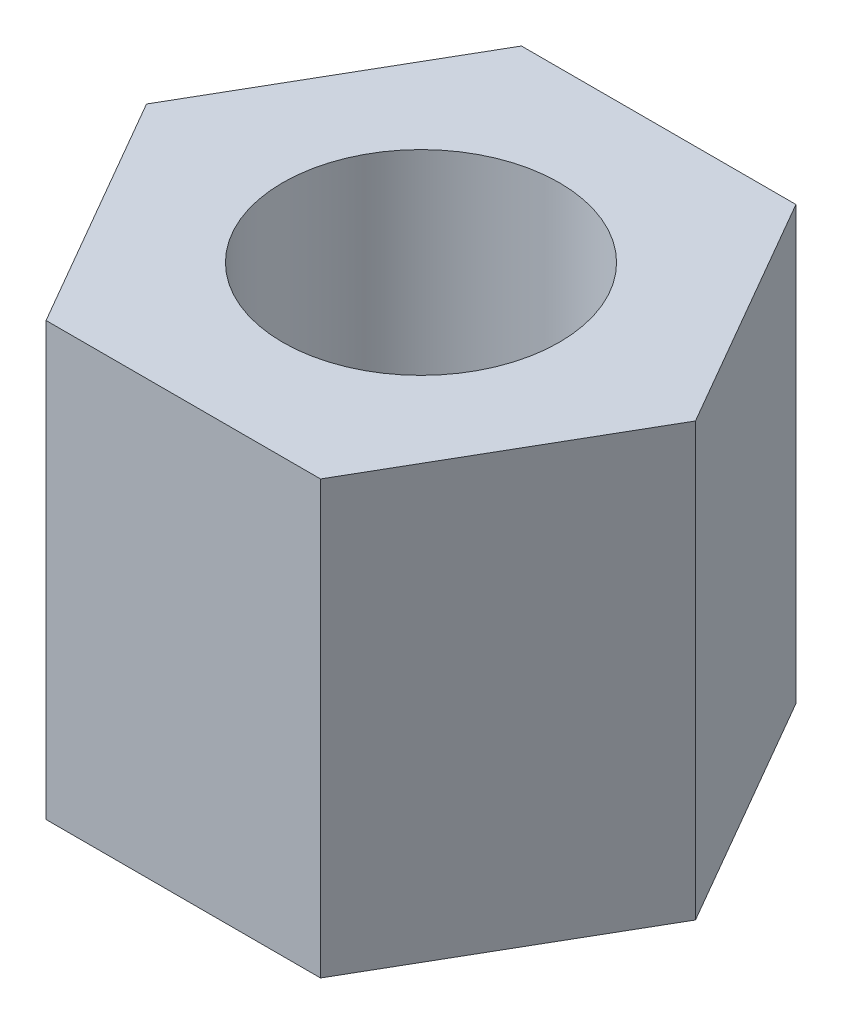
ISO-10303-21;
HEADER;
FILE_DESCRIPTION(('STEP AP214'),'2;1');
FILE_NAME('part.step','',(''),(''),'','','');
FILE_SCHEMA(('AUTOMOTIVE_DESIGN { 1 0 10303 214 1 1 1 1 }'));
ENDSEC;
DATA;
#1=APPLICATION_CONTEXT('core data for automotive mechanical design processes');
#2=APPLICATION_PROTOCOL_DEFINITION('international standard','automotive_design',2000,#1);
#3=PRODUCT_CONTEXT('',#1,'mechanical');
#4=PRODUCT('Part','Part','',(#3));
#5=PRODUCT_RELATED_PRODUCT_CATEGORY('part','',(#4));
#6=PRODUCT_DEFINITION_FORMATION('','',#4);
#7=PRODUCT_DEFINITION_CONTEXT('part definition',#1,'design');
#8=PRODUCT_DEFINITION('design','',#6,#7);
#9=PRODUCT_DEFINITION_SHAPE('','',#8);
#10=(LENGTH_UNIT() NAMED_UNIT(*) SI_UNIT(.MILLI.,.METRE.));
#11=(NAMED_UNIT(*) PLANE_ANGLE_UNIT() SI_UNIT($,.RADIAN.));
#12=(NAMED_UNIT(*) SI_UNIT($,.STERADIAN.) SOLID_ANGLE_UNIT());
#13=UNCERTAINTY_MEASURE_WITH_UNIT(LENGTH_MEASURE(1.E-05),#10,'distance_accuracy_value','');
#14=(GEOMETRIC_REPRESENTATION_CONTEXT(3) GLOBAL_UNCERTAINTY_ASSIGNED_CONTEXT((#13)) GLOBAL_UNIT_ASSIGNED_CONTEXT((#10,
#11,#12)) REPRESENTATION_CONTEXT('',''));
#15=CARTESIAN_POINT('',(0.,0.,0.));
#16=DIRECTION('',(0.,0.,1.));
#17=DIRECTION('',(1.,0.,0.));
#18=AXIS2_PLACEMENT_3D('',#15,#16,#17);
#19=CARTESIAN_POINT('',(1.58771324027147,5.,2.75));
#20=DIRECTION('',(-0.866025403784439,0.,-0.5));
#21=DIRECTION('',(-0.5,0.,0.866025403784439));
#22=AXIS2_PLACEMENT_3D('',#19,#20,#21);
#23=PLANE('',#22);
#24=DIRECTION('',(0.5,0.,-0.866025403784439));
#25=VECTOR('',#24,1.);
#26=CARTESIAN_POINT('',(1.58771324027147,0.,2.75));
#27=LINE('',#26,#25);
#28=CARTESIAN_POINT('',(1.58771324027147,0.,2.75));
#29=VERTEX_POINT('',#28);
#30=CARTESIAN_POINT('',(3.17542648054294,0.,0.));
#31=VERTEX_POINT('',#30);
#32=EDGE_CURVE('E119',#29,#31,#27,.T.);
#33=ORIENTED_EDGE('',*,*,#32,.T.);
#34=DIRECTION('',(0.,-1.,0.));
#35=VECTOR('',#34,1.);
#36=CARTESIAN_POINT('',(3.17542648054294,5.,0.));
#37=LINE('',#36,#35);
#38=CARTESIAN_POINT('',(3.17542648054294,5.,0.));
#39=VERTEX_POINT('',#38);
#40=EDGE_CURVE('E11',#39,#31,#37,.T.);
#41=ORIENTED_EDGE('',*,*,#40,.F.);
#42=DIRECTION('',(0.5,0.,-0.866025403784439));
#43=VECTOR('',#42,1.);
#44=CARTESIAN_POINT('',(1.58771324027147,5.,2.75));
#45=LINE('',#44,#43);
#46=CARTESIAN_POINT('',(1.58771324027147,5.,2.75));
#47=VERTEX_POINT('',#46);
#48=EDGE_CURVE('E130',#47,#39,#45,.T.);
#49=ORIENTED_EDGE('',*,*,#48,.F.);
#50=DIRECTION('',(0.,-1.,0.));
#51=VECTOR('',#50,1.);
#52=CARTESIAN_POINT('',(1.58771324027147,5.,2.75));
#53=LINE('',#52,#51);
#54=EDGE_CURVE('E115',#47,#29,#53,.T.);
#55=ORIENTED_EDGE('',*,*,#54,.T.);
#56=EDGE_LOOP('',(#33,#41,#49,#55));
#57=FACE_BOUND('',#56,.T.);
#58=ADVANCED_FACE('F35',(#57),#23,.F.);
#59=CARTESIAN_POINT('',(3.17542648054294,5.,0.));
#60=DIRECTION('',(-0.866025403784439,0.,0.5));
#61=DIRECTION('',(0.5,0.,0.866025403784439));
#62=AXIS2_PLACEMENT_3D('',#59,#60,#61);
#63=PLANE('',#62);
#64=DIRECTION('',(-0.5,0.,-0.866025403784438));
#65=VECTOR('',#64,1.);
#66=CARTESIAN_POINT('',(3.17542648054294,0.,0.));
#67=LINE('',#66,#65);
#68=CARTESIAN_POINT('',(1.58771324027147,0.,-2.75));
#69=VERTEX_POINT('',#68);
#70=EDGE_CURVE('E122',#31,#69,#67,.T.);
#71=ORIENTED_EDGE('',*,*,#70,.T.);
#72=DIRECTION('',(0.,-1.,0.));
#73=VECTOR('',#72,1.);
#74=CARTESIAN_POINT('',(1.58771324027147,5.,-2.75));
#75=LINE('',#74,#73);
#76=CARTESIAN_POINT('',(1.58771324027147,5.,-2.75));
#77=VERTEX_POINT('',#76);
#78=EDGE_CURVE('E43',#77,#69,#75,.T.);
#79=ORIENTED_EDGE('',*,*,#78,.F.);
#80=DIRECTION('',(-0.5,0.,-0.866025403784438));
#81=VECTOR('',#80,1.);
#82=CARTESIAN_POINT('',(3.17542648054294,5.,0.));
#83=LINE('',#82,#81);
#84=EDGE_CURVE('E88',#39,#77,#83,.T.);
#85=ORIENTED_EDGE('',*,*,#84,.F.);
#86=ORIENTED_EDGE('',*,*,#40,.T.);
#87=EDGE_LOOP('',(#71,#79,#85,#86));
#88=FACE_BOUND('',#87,.T.);
#89=ADVANCED_FACE('F155',(#88),#63,.F.);
#90=CARTESIAN_POINT('',(1.58771324027147,5.,-2.75));
#91=DIRECTION('',(0.,0.,1.));
#92=DIRECTION('',(1.,0.,0.));
#93=AXIS2_PLACEMENT_3D('',#90,#91,#92);
#94=PLANE('',#93);
#95=DIRECTION('',(-1.,0.,0.));
#96=VECTOR('',#95,1.);
#97=CARTESIAN_POINT('',(1.58771324027147,0.,-2.75));
#98=LINE('',#97,#96);
#99=CARTESIAN_POINT('',(-1.58771324027147,0.,-2.75));
#100=VERTEX_POINT('',#99);
#101=EDGE_CURVE('E125',#69,#100,#98,.T.);
#102=ORIENTED_EDGE('',*,*,#101,.T.);
#103=DIRECTION('',(0.,-1.,0.));
#104=VECTOR('',#103,1.);
#105=CARTESIAN_POINT('',(-1.58771324027147,5.,-2.75));
#106=LINE('',#105,#104);
#107=CARTESIAN_POINT('',(-1.58771324027147,5.,-2.75));
#108=VERTEX_POINT('',#107);
#109=EDGE_CURVE('E110',#108,#100,#106,.T.);
#110=ORIENTED_EDGE('',*,*,#109,.F.);
#111=DIRECTION('',(-1.,0.,0.));
#112=VECTOR('',#111,1.);
#113=CARTESIAN_POINT('',(1.58771324027147,5.,-2.75));
#114=LINE('',#113,#112);
#115=EDGE_CURVE('E101',#77,#108,#114,.T.);
#116=ORIENTED_EDGE('',*,*,#115,.F.);
#117=ORIENTED_EDGE('',*,*,#78,.T.);
#118=EDGE_LOOP('',(#102,#110,#116,#117));
#119=FACE_BOUND('',#118,.T.);
#120=ADVANCED_FACE('F136',(#119),#94,.F.);
#121=CARTESIAN_POINT('',(-1.58771324027147,5.,-2.75));
#122=DIRECTION('',(0.866025403784439,0.,0.5));
#123=DIRECTION('',(0.5,0.,-0.866025403784439));
#124=AXIS2_PLACEMENT_3D('',#121,#122,#123);
#125=PLANE('',#124);
#126=DIRECTION('',(-0.5,0.,0.866025403784439));
#127=VECTOR('',#126,1.);
#128=CARTESIAN_POINT('',(-1.58771324027147,0.,-2.75));
#129=LINE('',#128,#127);
#130=CARTESIAN_POINT('',(-3.17542648054294,0.,0.));
#131=VERTEX_POINT('',#130);
#132=EDGE_CURVE('E109',#100,#131,#129,.T.);
#133=ORIENTED_EDGE('',*,*,#132,.T.);
#134=DIRECTION('',(0.,-1.,0.));
#135=VECTOR('',#134,1.);
#136=CARTESIAN_POINT('',(-3.17542648054294,5.,0.));
#137=LINE('',#136,#135);
#138=CARTESIAN_POINT('',(-3.17542648054294,5.,0.));
#139=VERTEX_POINT('',#138);
#140=EDGE_CURVE('E106',#139,#131,#137,.T.);
#141=ORIENTED_EDGE('',*,*,#140,.F.);
#142=DIRECTION('',(-0.5,0.,0.866025403784439));
#143=VECTOR('',#142,1.);
#144=CARTESIAN_POINT('',(-1.58771324027147,5.,-2.75));
#145=LINE('',#144,#143);
#146=EDGE_CURVE('E95',#108,#139,#145,.T.);
#147=ORIENTED_EDGE('',*,*,#146,.F.);
#148=ORIENTED_EDGE('',*,*,#109,.T.);
#149=EDGE_LOOP('',(#133,#141,#147,#148));
#150=FACE_BOUND('',#149,.T.);
#151=ADVANCED_FACE('F107',(#150),#125,.F.);
#152=CARTESIAN_POINT('',(-3.17542648054294,5.,0.));
#153=DIRECTION('',(0.866025403784439,0.,-0.5));
#154=DIRECTION('',(-0.5,0.,-0.866025403784439));
#155=AXIS2_PLACEMENT_3D('',#152,#153,#154);
#156=PLANE('',#155);
#157=DIRECTION('',(0.5,0.,0.866025403784439));
#158=VECTOR('',#157,1.);
#159=CARTESIAN_POINT('',(-3.17542648054294,0.,0.));
#160=LINE('',#159,#158);
#161=CARTESIAN_POINT('',(-1.58771324027147,0.,2.75));
#162=VERTEX_POINT('',#161);
#163=EDGE_CURVE('E74',#131,#162,#160,.T.);
#164=ORIENTED_EDGE('',*,*,#163,.T.);
#165=DIRECTION('',(0.,-1.,0.));
#166=VECTOR('',#165,1.);
#167=CARTESIAN_POINT('',(-1.58771324027147,5.,2.75));
#168=LINE('',#167,#166);
#169=CARTESIAN_POINT('',(-1.58771324027147,5.,2.75));
#170=VERTEX_POINT('',#169);
#171=EDGE_CURVE('E111',#170,#162,#168,.T.);
#172=ORIENTED_EDGE('',*,*,#171,.F.);
#173=DIRECTION('',(0.5,0.,0.866025403784439));
#174=VECTOR('',#173,1.);
#175=CARTESIAN_POINT('',(-3.17542648054294,5.,0.));
#176=LINE('',#175,#174);
#177=EDGE_CURVE('E99',#139,#170,#176,.T.);
#178=ORIENTED_EDGE('',*,*,#177,.F.);
#179=ORIENTED_EDGE('',*,*,#140,.T.);
#180=EDGE_LOOP('',(#164,#172,#178,#179));
#181=FACE_BOUND('',#180,.T.);
#182=ADVANCED_FACE('F113',(#181),#156,.F.);
#183=CARTESIAN_POINT('',(-1.58771324027147,5.,2.75));
#184=DIRECTION('',(0.,0.,-1.));
#185=DIRECTION('',(-1.,0.,0.));
#186=AXIS2_PLACEMENT_3D('',#183,#184,#185);
#187=PLANE('',#186);
#188=DIRECTION('',(1.,0.,0.));
#189=VECTOR('',#188,1.);
#190=CARTESIAN_POINT('',(-1.58771324027147,0.,2.75));
#191=LINE('',#190,#189);
#192=EDGE_CURVE('E80',#162,#29,#191,.T.);
#193=ORIENTED_EDGE('',*,*,#192,.T.);
#194=ORIENTED_EDGE('',*,*,#54,.F.);
#195=DIRECTION('',(1.,0.,0.));
#196=VECTOR('',#195,1.);
#197=CARTESIAN_POINT('',(-1.58771324027147,5.,2.75));
#198=LINE('',#197,#196);
#199=EDGE_CURVE('E51',#170,#47,#198,.T.);
#200=ORIENTED_EDGE('',*,*,#199,.F.);
#201=ORIENTED_EDGE('',*,*,#171,.T.);
#202=EDGE_LOOP('',(#193,#194,#200,#201));
#203=FACE_BOUND('',#202,.T.);
#204=ADVANCED_FACE('F143',(#203),#187,.F.);
#205=CARTESIAN_POINT('',(0.,5.,0.));
#206=DIRECTION('',(0.,1.,0.));
#207=DIRECTION('',(0.,0.,1.));
#208=AXIS2_PLACEMENT_3D('',#205,#206,#207);
#209=PLANE('',#208);
#210=CARTESIAN_POINT('',(0.,5.,0.));
#211=DIRECTION('',(0.,1.,0.));
#212=DIRECTION('',(0.,0.,1.));
#213=AXIS2_PLACEMENT_3D('',#210,#211,#212);
#214=CIRCLE('',#213,1.6);
#215=CARTESIAN_POINT('',(0.,5.,1.6));
#216=VERTEX_POINT('',#215);
#217=EDGE_CURVE('E210',#216,#216,#214,.T.);
#218=ORIENTED_EDGE('',*,*,#217,.F.);
#219=EDGE_LOOP('',(#218));
#220=FACE_BOUND('',#219,.T.);
#221=ORIENTED_EDGE('',*,*,#48,.T.);
#222=ORIENTED_EDGE('',*,*,#84,.T.);
#223=ORIENTED_EDGE('',*,*,#115,.T.);
#224=ORIENTED_EDGE('',*,*,#146,.T.);
#225=ORIENTED_EDGE('',*,*,#177,.T.);
#226=ORIENTED_EDGE('',*,*,#199,.T.);
#227=EDGE_LOOP('',(#221,#222,#223,#224,#225,#226));
#228=FACE_BOUND('',#227,.T.);
#229=ADVANCED_FACE('F97',(#220,#228),#209,.T.);
#230=CARTESIAN_POINT('',(0.,0.,0.));
#231=DIRECTION('',(0.,1.,0.));
#232=DIRECTION('',(0.,0.,1.));
#233=AXIS2_PLACEMENT_3D('',#230,#231,#232);
#234=PLANE('',#233);
#235=CARTESIAN_POINT('',(0.,0.,0.));
#236=DIRECTION('',(0.,1.,0.));
#237=DIRECTION('',(0.,0.,1.));
#238=AXIS2_PLACEMENT_3D('',#235,#236,#237);
#239=CIRCLE('',#238,1.6);
#240=CARTESIAN_POINT('',(0.,0.,1.6));
#241=VERTEX_POINT('',#240);
#242=EDGE_CURVE('E123',#241,#241,#239,.T.);
#243=ORIENTED_EDGE('',*,*,#242,.T.);
#244=EDGE_LOOP('',(#243));
#245=FACE_BOUND('',#244,.T.);
#246=ORIENTED_EDGE('',*,*,#32,.F.);
#247=ORIENTED_EDGE('',*,*,#192,.F.);
#248=ORIENTED_EDGE('',*,*,#163,.F.);
#249=ORIENTED_EDGE('',*,*,#132,.F.);
#250=ORIENTED_EDGE('',*,*,#101,.F.);
#251=ORIENTED_EDGE('',*,*,#70,.F.);
#252=EDGE_LOOP('',(#246,#247,#248,#249,#250,#251));
#253=FACE_BOUND('',#252,.T.);
#254=ADVANCED_FACE('F139',(#245,#253),#234,.F.);
#255=CARTESIAN_POINT('',(0.,0.,0.));
#256=DIRECTION('',(0.,1.,0.));
#257=DIRECTION('',(0.,0.,1.));
#258=AXIS2_PLACEMENT_3D('',#255,#256,#257);
#259=CYLINDRICAL_SURFACE('',#258,1.6);
#260=ORIENTED_EDGE('',*,*,#242,.F.);
#261=EDGE_LOOP('',(#260));
#262=FACE_BOUND('',#261,.T.);
#263=ORIENTED_EDGE('',*,*,#217,.T.);
#264=EDGE_LOOP('',(#263));
#265=FACE_BOUND('',#264,.T.);
#266=ADVANCED_FACE('F192',(#262,#265),#259,.F.);
#267=CLOSED_SHELL('',(#58,#89,#120,#151,#182,#204,#229,#254,#266));
#268=MANIFOLD_SOLID_BREP('B2',#267);
#269=ADVANCED_BREP_SHAPE_REPRESENTATION('',(#18,#268),#14);
#270=SHAPE_DEFINITION_REPRESENTATION(#9,#269);
ENDSEC;
END-ISO-10303-21;
